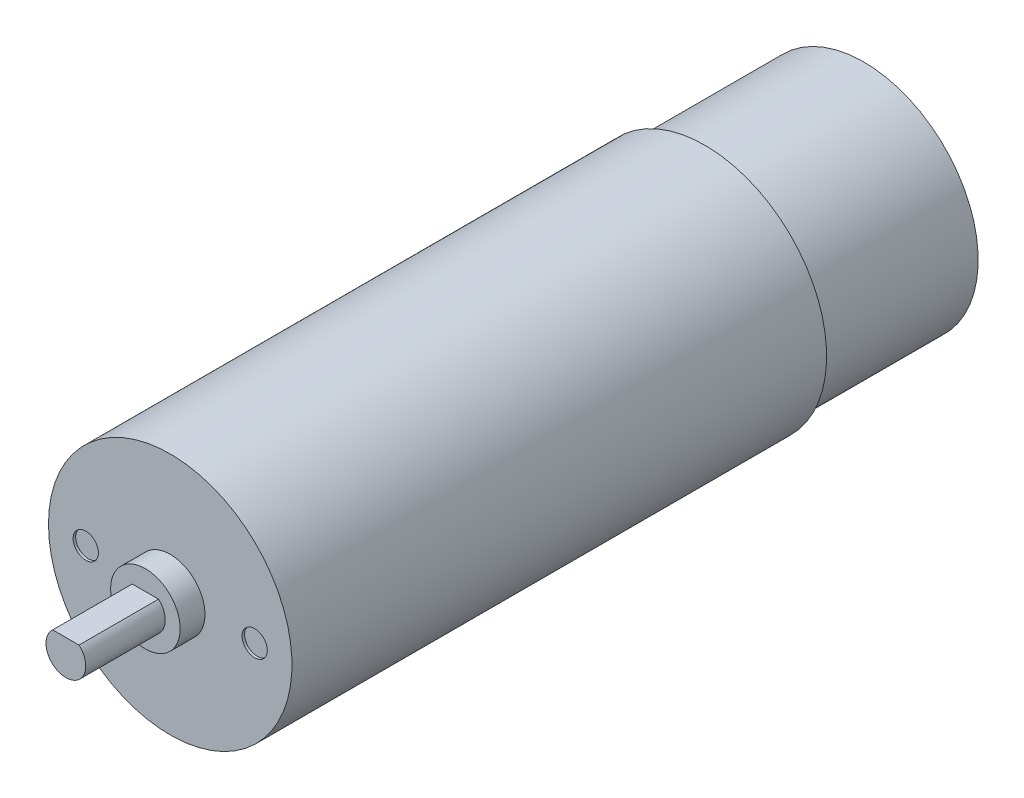
ISO-10303-21;
HEADER;
FILE_DESCRIPTION(('STEP AP214'),'2;1');
FILE_NAME('part.step','',(''),(''),'','','');
FILE_SCHEMA(('AUTOMOTIVE_DESIGN { 1 0 10303 214 1 1 1 1 }'));
ENDSEC;
DATA;
#1=APPLICATION_CONTEXT('core data for automotive mechanical design processes');
#2=APPLICATION_PROTOCOL_DEFINITION('international standard','automotive_design',2000,#1);
#3=PRODUCT_CONTEXT('',#1,'mechanical');
#4=PRODUCT('Part','Part','',(#3));
#5=PRODUCT_RELATED_PRODUCT_CATEGORY('part','',(#4));
#6=PRODUCT_DEFINITION_FORMATION('','',#4);
#7=PRODUCT_DEFINITION_CONTEXT('part definition',#1,'design');
#8=PRODUCT_DEFINITION('design','',#6,#7);
#9=PRODUCT_DEFINITION_SHAPE('','',#8);
#10=(LENGTH_UNIT() NAMED_UNIT(*) SI_UNIT(.MILLI.,.METRE.));
#11=(NAMED_UNIT(*) PLANE_ANGLE_UNIT() SI_UNIT($,.RADIAN.));
#12=(NAMED_UNIT(*) SI_UNIT($,.STERADIAN.) SOLID_ANGLE_UNIT());
#13=UNCERTAINTY_MEASURE_WITH_UNIT(LENGTH_MEASURE(1.E-05),#10,'distance_accuracy_value','');
#14=(GEOMETRIC_REPRESENTATION_CONTEXT(3) GLOBAL_UNCERTAINTY_ASSIGNED_CONTEXT((#13)) GLOBAL_UNIT_ASSIGNED_CONTEXT((#10,
#11,#12)) REPRESENTATION_CONTEXT('',''));
#15=CARTESIAN_POINT('',(0.,0.,0.));
#16=DIRECTION('',(0.,0.,1.));
#17=DIRECTION('',(1.,0.,0.));
#18=AXIS2_PLACEMENT_3D('',#15,#16,#17);
#19=CARTESIAN_POINT('',(0.,0.,-56.3));
#20=DIRECTION('',(0.,0.,-1.));
#21=DIRECTION('',(-1.,0.,0.));
#22=AXIS2_PLACEMENT_3D('',#19,#20,#21);
#23=PLANE('',#22);
#24=CARTESIAN_POINT('',(0.,0.,-56.3));
#25=DIRECTION('',(0.,0.,-1.));
#26=DIRECTION('',(-1.,0.,0.));
#27=AXIS2_PLACEMENT_3D('',#24,#25,#26);
#28=CIRCLE('',#27,12.25);
#29=CARTESIAN_POINT('',(-12.25,0.,-56.3));
#30=VERTEX_POINT('',#29);
#31=EDGE_CURVE('E95',#30,#30,#28,.T.);
#32=ORIENTED_EDGE('',*,*,#31,.T.);
#33=EDGE_LOOP('',(#32));
#34=FACE_BOUND('',#33,.T.);
#35=CARTESIAN_POINT('',(0.,0.,-56.3));
#36=DIRECTION('',(0.,0.,-1.));
#37=DIRECTION('',(-1.,0.,0.));
#38=AXIS2_PLACEMENT_3D('',#35,#36,#37);
#39=CIRCLE('',#38,11.5);
#40=CARTESIAN_POINT('',(-11.5,0.,-56.3));
#41=VERTEX_POINT('',#40);
#42=EDGE_CURVE('E73',#41,#41,#39,.T.);
#43=ORIENTED_EDGE('',*,*,#42,.F.);
#44=EDGE_LOOP('',(#43));
#45=FACE_BOUND('',#44,.T.);
#46=ADVANCED_FACE('F36',(#34,#45),#23,.T.);
#47=CARTESIAN_POINT('',(0.,0.,8.));
#48=DIRECTION('',(0.,0.,-1.));
#49=DIRECTION('',(-1.,0.,0.));
#50=AXIS2_PLACEMENT_3D('',#47,#48,#49);
#51=CYLINDRICAL_SURFACE('',#50,2.);
#52=CARTESIAN_POINT('',(0.,0.,8.));
#53=DIRECTION('',(0.,0.,1.));
#54=DIRECTION('',(1.,0.,0.));
#55=AXIS2_PLACEMENT_3D('',#52,#53,#54);
#56=CIRCLE('',#55,2.);
#57=CARTESIAN_POINT('',(-1.3228756555323,1.5,8.));
#58=VERTEX_POINT('',#57);
#59=CARTESIAN_POINT('',(1.3228756555323,1.5,8.));
#60=VERTEX_POINT('',#59);
#61=EDGE_CURVE('E11',#58,#60,#56,.T.);
#62=ORIENTED_EDGE('',*,*,#61,.F.);
#63=DIRECTION('',(0.,0.,1.));
#64=VECTOR('',#63,1.);
#65=CARTESIAN_POINT('',(-1.3228756555323,1.5,0.));
#66=LINE('',#65,#64);
#67=CARTESIAN_POINT('',(-1.3228756555323,1.5,0.));
#68=VERTEX_POINT('',#67);
#69=EDGE_CURVE('E60',#68,#58,#66,.T.);
#70=ORIENTED_EDGE('',*,*,#69,.F.);
#71=CARTESIAN_POINT('',(0.,0.,0.));
#72=DIRECTION('',(0.,0.,-1.));
#73=DIRECTION('',(-1.,0.,0.));
#74=AXIS2_PLACEMENT_3D('',#71,#72,#73);
#75=CIRCLE('',#74,2.);
#76=CARTESIAN_POINT('',(1.3228756555323,1.5,0.));
#77=VERTEX_POINT('',#76);
#78=EDGE_CURVE('E44',#77,#68,#75,.T.);
#79=ORIENTED_EDGE('',*,*,#78,.F.);
#80=DIRECTION('',(0.,0.,1.));
#81=VECTOR('',#80,1.);
#82=CARTESIAN_POINT('',(1.3228756555323,1.5,0.));
#83=LINE('',#82,#81);
#84=EDGE_CURVE('E68',#77,#60,#83,.T.);
#85=ORIENTED_EDGE('',*,*,#84,.T.);
#86=EDGE_LOOP('',(#62,#70,#79,#85));
#87=FACE_BOUND('',#86,.T.);
#88=ADVANCED_FACE('F38',(#87),#51,.T.);
#89=CARTESIAN_POINT('',(0.,0.,8.));
#90=DIRECTION('',(0.,0.,1.));
#91=DIRECTION('',(1.,0.,0.));
#92=AXIS2_PLACEMENT_3D('',#89,#90,#91);
#93=PLANE('',#92);
#94=DIRECTION('',(1.,0.,0.));
#95=VECTOR('',#94,1.);
#96=CARTESIAN_POINT('',(-1.3228756555323,1.5,8.));
#97=LINE('',#96,#95);
#98=EDGE_CURVE('E63',#58,#60,#97,.T.);
#99=ORIENTED_EDGE('',*,*,#98,.F.);
#100=ORIENTED_EDGE('',*,*,#61,.T.);
#101=EDGE_LOOP('',(#99,#100));
#102=FACE_BOUND('',#101,.T.);
#103=ADVANCED_FACE('F71',(#102),#93,.T.);
#104=CARTESIAN_POINT('',(0.,0.,0.));
#105=DIRECTION('',(0.,0.,-1.));
#106=DIRECTION('',(-1.,0.,0.));
#107=AXIS2_PLACEMENT_3D('',#104,#105,#106);
#108=PLANE('',#107);
#109=CARTESIAN_POINT('',(0.,0.,0.));
#110=DIRECTION('',(0.,0.,-1.));
#111=DIRECTION('',(-1.,0.,0.));
#112=AXIS2_PLACEMENT_3D('',#109,#110,#111);
#113=CIRCLE('',#112,3.5);
#114=CARTESIAN_POINT('',(-3.5,0.,0.));
#115=VERTEX_POINT('',#114);
#116=EDGE_CURVE('E98',#115,#115,#113,.T.);
#117=ORIENTED_EDGE('',*,*,#116,.F.);
#118=EDGE_LOOP('',(#117));
#119=FACE_BOUND('',#118,.T.);
#120=ORIENTED_EDGE('',*,*,#78,.T.);
#121=DIRECTION('',(1.,0.,0.));
#122=VECTOR('',#121,1.);
#123=CARTESIAN_POINT('',(-1.3228756555323,1.5,0.));
#124=LINE('',#123,#122);
#125=EDGE_CURVE('E50',#68,#77,#124,.T.);
#126=ORIENTED_EDGE('',*,*,#125,.T.);
#127=EDGE_LOOP('',(#120,#126));
#128=FACE_BOUND('',#127,.T.);
#129=ADVANCED_FACE('F105',(#119,#128),#108,.F.);
#130=CARTESIAN_POINT('',(0.,0.,-2.5));
#131=DIRECTION('',(0.,0.,1.));
#132=DIRECTION('',(1.,0.,0.));
#133=AXIS2_PLACEMENT_3D('',#130,#131,#132);
#134=CYLINDRICAL_SURFACE('',#133,3.5);
#135=CARTESIAN_POINT('',(0.,0.,-2.5));
#136=DIRECTION('',(0.,0.,-1.));
#137=DIRECTION('',(-1.,0.,0.));
#138=AXIS2_PLACEMENT_3D('',#135,#136,#137);
#139=CIRCLE('',#138,3.5);
#140=CARTESIAN_POINT('',(-3.5,0.,-2.5));
#141=VERTEX_POINT('',#140);
#142=EDGE_CURVE('E101',#141,#141,#139,.T.);
#143=ORIENTED_EDGE('',*,*,#142,.F.);
#144=EDGE_LOOP('',(#143));
#145=FACE_BOUND('',#144,.T.);
#146=ORIENTED_EDGE('',*,*,#116,.T.);
#147=EDGE_LOOP('',(#146));
#148=FACE_BOUND('',#147,.T.);
#149=ADVANCED_FACE('F107',(#145,#148),#134,.T.);
#150=CARTESIAN_POINT('',(0.,0.,-2.5));
#151=DIRECTION('',(0.,0.,-1.));
#152=DIRECTION('',(-1.,0.,0.));
#153=AXIS2_PLACEMENT_3D('',#150,#151,#152);
#154=PLANE('',#153);
#155=CARTESIAN_POINT('',(-8.5,0.,-2.5));
#156=DIRECTION('',(0.,0.,1.));
#157=DIRECTION('',(1.,0.,0.));
#158=AXIS2_PLACEMENT_3D('',#155,#156,#157);
#159=CIRCLE('',#158,1.27);
#160=CARTESIAN_POINT('',(-7.23,0.,-2.5));
#161=VERTEX_POINT('',#160);
#162=EDGE_CURVE('E81',#161,#161,#159,.T.);
#163=ORIENTED_EDGE('',*,*,#162,.F.);
#164=EDGE_LOOP('',(#163));
#165=FACE_BOUND('',#164,.T.);
#166=CARTESIAN_POINT('',(8.5,0.,-2.5));
#167=DIRECTION('',(0.,0.,1.));
#168=DIRECTION('',(1.,0.,0.));
#169=AXIS2_PLACEMENT_3D('',#166,#167,#168);
#170=CIRCLE('',#169,1.27);
#171=CARTESIAN_POINT('',(9.77,0.,-2.5));
#172=VERTEX_POINT('',#171);
#173=EDGE_CURVE('E86',#172,#172,#170,.T.);
#174=ORIENTED_EDGE('',*,*,#173,.F.);
#175=EDGE_LOOP('',(#174));
#176=FACE_BOUND('',#175,.T.);
#177=CARTESIAN_POINT('',(0.,0.,-2.5));
#178=DIRECTION('',(0.,0.,-1.));
#179=DIRECTION('',(-1.,0.,0.));
#180=AXIS2_PLACEMENT_3D('',#177,#178,#179);
#181=CIRCLE('',#180,12.25);
#182=CARTESIAN_POINT('',(-12.25,0.,-2.5));
#183=VERTEX_POINT('',#182);
#184=EDGE_CURVE('E92',#183,#183,#181,.T.);
#185=ORIENTED_EDGE('',*,*,#184,.F.);
#186=EDGE_LOOP('',(#185));
#187=FACE_BOUND('',#186,.T.);
#188=ORIENTED_EDGE('',*,*,#142,.T.);
#189=EDGE_LOOP('',(#188));
#190=FACE_BOUND('',#189,.T.);
#191=ADVANCED_FACE('F114',(#165,#176,#187,#190),#154,.F.);
#192=CARTESIAN_POINT('',(0.,0.,-56.3));
#193=DIRECTION('',(0.,0.,1.));
#194=DIRECTION('',(1.,0.,0.));
#195=AXIS2_PLACEMENT_3D('',#192,#193,#194);
#196=CYLINDRICAL_SURFACE('',#195,12.25);
#197=ORIENTED_EDGE('',*,*,#31,.F.);
#198=EDGE_LOOP('',(#197));
#199=FACE_BOUND('',#198,.T.);
#200=ORIENTED_EDGE('',*,*,#184,.T.);
#201=EDGE_LOOP('',(#200));
#202=FACE_BOUND('',#201,.T.);
#203=ADVANCED_FACE('F131',(#199,#202),#196,.T.);
#204=CARTESIAN_POINT('',(8.5,0.,-2.754));
#205=DIRECTION('',(0.,0.,1.));
#206=DIRECTION('',(1.,0.,0.));
#207=AXIS2_PLACEMENT_3D('',#204,#205,#206);
#208=CYLINDRICAL_SURFACE('',#207,1.27);
#209=CARTESIAN_POINT('',(8.5,0.,-2.754));
#210=DIRECTION('',(0.,0.,1.));
#211=DIRECTION('',(1.,0.,0.));
#212=AXIS2_PLACEMENT_3D('',#209,#210,#211);
#213=CIRCLE('',#212,1.27);
#214=CARTESIAN_POINT('',(9.77,0.,-2.754));
#215=VERTEX_POINT('',#214);
#216=EDGE_CURVE('E89',#215,#215,#213,.T.);
#217=ORIENTED_EDGE('',*,*,#216,.F.);
#218=EDGE_LOOP('',(#217));
#219=FACE_BOUND('',#218,.T.);
#220=ORIENTED_EDGE('',*,*,#173,.T.);
#221=EDGE_LOOP('',(#220));
#222=FACE_BOUND('',#221,.T.);
#223=ADVANCED_FACE('F128',(#219,#222),#208,.F.);
#224=CARTESIAN_POINT('',(8.5,0.,-2.754));
#225=DIRECTION('',(0.,0.,1.));
#226=DIRECTION('',(1.,0.,0.));
#227=AXIS2_PLACEMENT_3D('',#224,#225,#226);
#228=PLANE('',#227);
#229=ORIENTED_EDGE('',*,*,#216,.T.);
#230=EDGE_LOOP('',(#229));
#231=FACE_BOUND('',#230,.T.);
#232=ADVANCED_FACE('F138',(#231),#228,.T.);
#233=CARTESIAN_POINT('',(-8.5,0.,-2.754));
#234=DIRECTION('',(0.,0.,1.));
#235=DIRECTION('',(1.,0.,0.));
#236=AXIS2_PLACEMENT_3D('',#233,#234,#235);
#237=CYLINDRICAL_SURFACE('',#236,1.27);
#238=CARTESIAN_POINT('',(-8.5,0.,-2.754));
#239=DIRECTION('',(0.,0.,1.));
#240=DIRECTION('',(1.,0.,0.));
#241=AXIS2_PLACEMENT_3D('',#238,#239,#240);
#242=CIRCLE('',#241,1.27);
#243=CARTESIAN_POINT('',(-7.23,0.,-2.754));
#244=VERTEX_POINT('',#243);
#245=EDGE_CURVE('E83',#244,#244,#242,.T.);
#246=ORIENTED_EDGE('',*,*,#245,.F.);
#247=EDGE_LOOP('',(#246));
#248=FACE_BOUND('',#247,.T.);
#249=ORIENTED_EDGE('',*,*,#162,.T.);
#250=EDGE_LOOP('',(#249));
#251=FACE_BOUND('',#250,.T.);
#252=ADVANCED_FACE('F150',(#248,#251),#237,.F.);
#253=CARTESIAN_POINT('',(-8.5,0.,-2.754));
#254=DIRECTION('',(0.,0.,1.));
#255=DIRECTION('',(1.,0.,0.));
#256=AXIS2_PLACEMENT_3D('',#253,#254,#255);
#257=PLANE('',#256);
#258=ORIENTED_EDGE('',*,*,#245,.T.);
#259=EDGE_LOOP('',(#258));
#260=FACE_BOUND('',#259,.T.);
#261=ADVANCED_FACE('F159',(#260),#257,.T.);
#262=CARTESIAN_POINT('',(0.,0.,-72.3));
#263=DIRECTION('',(0.,0.,1.));
#264=DIRECTION('',(1.,0.,0.));
#265=AXIS2_PLACEMENT_3D('',#262,#263,#264);
#266=CYLINDRICAL_SURFACE('',#265,11.5);
#267=CARTESIAN_POINT('',(0.,0.,-72.3));
#268=DIRECTION('',(0.,0.,-1.));
#269=DIRECTION('',(-1.,0.,0.));
#270=AXIS2_PLACEMENT_3D('',#267,#268,#269);
#271=CIRCLE('',#270,11.5);
#272=CARTESIAN_POINT('',(-11.5,0.,-72.3));
#273=VERTEX_POINT('',#272);
#274=EDGE_CURVE('E76',#273,#273,#271,.T.);
#275=ORIENTED_EDGE('',*,*,#274,.F.);
#276=EDGE_LOOP('',(#275));
#277=FACE_BOUND('',#276,.T.);
#278=ORIENTED_EDGE('',*,*,#42,.T.);
#279=EDGE_LOOP('',(#278));
#280=FACE_BOUND('',#279,.T.);
#281=ADVANCED_FACE('F165',(#277,#280),#266,.T.);
#282=CARTESIAN_POINT('',(0.,0.,-72.3));
#283=DIRECTION('',(0.,0.,-1.));
#284=DIRECTION('',(-1.,0.,0.));
#285=AXIS2_PLACEMENT_3D('',#282,#283,#284);
#286=PLANE('',#285);
#287=ORIENTED_EDGE('',*,*,#274,.T.);
#288=EDGE_LOOP('',(#287));
#289=FACE_BOUND('',#288,.T.);
#290=ADVANCED_FACE('F169',(#289),#286,.T.);
#291=CARTESIAN_POINT('',(-1.3228756555323,1.5,0.));
#292=DIRECTION('',(0.,-1.,0.));
#293=DIRECTION('',(0.,0.,-1.));
#294=AXIS2_PLACEMENT_3D('',#291,#292,#293);
#295=PLANE('',#294);
#296=ORIENTED_EDGE('',*,*,#98,.T.);
#297=ORIENTED_EDGE('',*,*,#84,.F.);
#298=ORIENTED_EDGE('',*,*,#125,.F.);
#299=ORIENTED_EDGE('',*,*,#69,.T.);
#300=EDGE_LOOP('',(#296,#297,#298,#299));
#301=FACE_BOUND('',#300,.T.);
#302=ADVANCED_FACE('F62',(#301),#295,.F.);
#303=CLOSED_SHELL('',(#46,#88,#103,#129,#149,#191,#203,#223,#232,#252,#261,#281,#290,#302));
#304=MANIFOLD_SOLID_BREP('B2',#303);
#305=ADVANCED_BREP_SHAPE_REPRESENTATION('',(#18,#304),#14);
#306=SHAPE_DEFINITION_REPRESENTATION(#9,#305);
ENDSEC;
END-ISO-10303-21;
